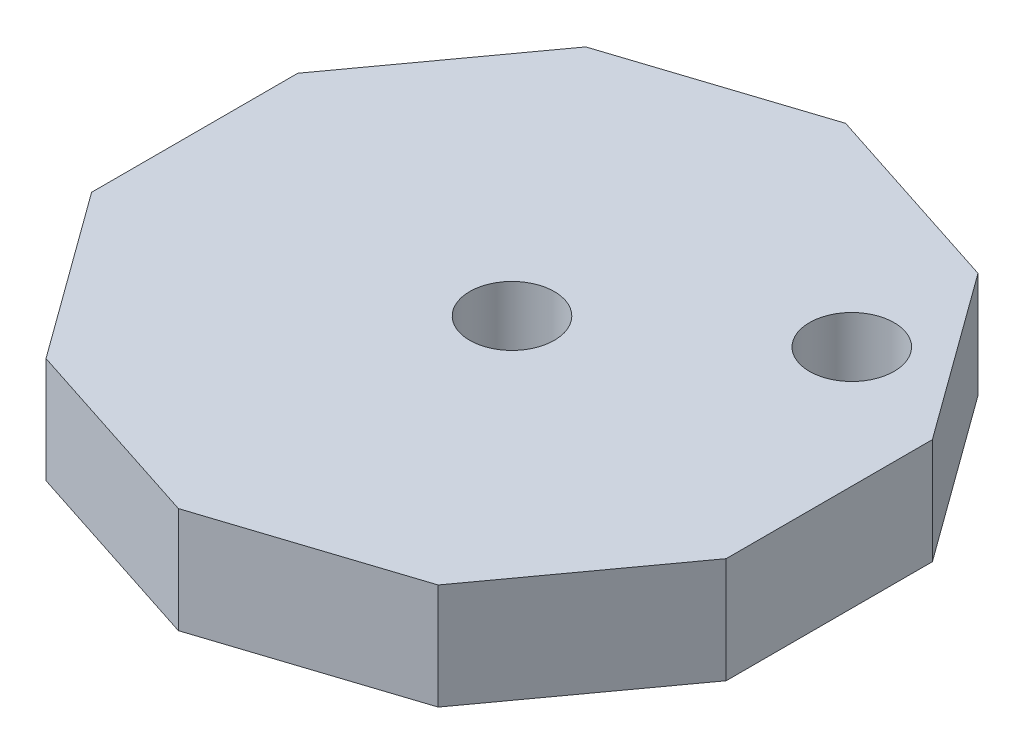
ISO-10303-21;
HEADER;
FILE_DESCRIPTION(('STEP AP214'),'2;1');
FILE_NAME('part.step','',(''),(''),'','','');
FILE_SCHEMA(('AUTOMOTIVE_DESIGN { 1 0 10303 214 1 1 1 1 }'));
ENDSEC;
DATA;
#1=APPLICATION_CONTEXT('core data for automotive mechanical design processes');
#2=APPLICATION_PROTOCOL_DEFINITION('international standard','automotive_design',2000,#1);
#3=PRODUCT_CONTEXT('',#1,'mechanical');
#4=PRODUCT('Part','Part','',(#3));
#5=PRODUCT_RELATED_PRODUCT_CATEGORY('part','',(#4));
#6=PRODUCT_DEFINITION_FORMATION('','',#4);
#7=PRODUCT_DEFINITION_CONTEXT('part definition',#1,'design');
#8=PRODUCT_DEFINITION('design','',#6,#7);
#9=PRODUCT_DEFINITION_SHAPE('','',#8);
#10=(LENGTH_UNIT() NAMED_UNIT(*) SI_UNIT(.MILLI.,.METRE.));
#11=(NAMED_UNIT(*) PLANE_ANGLE_UNIT() SI_UNIT($,.RADIAN.));
#12=(NAMED_UNIT(*) SI_UNIT($,.STERADIAN.) SOLID_ANGLE_UNIT());
#13=UNCERTAINTY_MEASURE_WITH_UNIT(LENGTH_MEASURE(1.E-05),#10,'distance_accuracy_value','');
#14=(GEOMETRIC_REPRESENTATION_CONTEXT(3) GLOBAL_UNCERTAINTY_ASSIGNED_CONTEXT((#13)) GLOBAL_UNIT_ASSIGNED_CONTEXT((#10,
#11,#12)) REPRESENTATION_CONTEXT('',''));
#15=CARTESIAN_POINT('',(0.,0.,0.));
#16=DIRECTION('',(0.,0.,1.));
#17=DIRECTION('',(1.,0.,0.));
#18=AXIS2_PLACEMENT_3D('',#15,#16,#17);
#19=CARTESIAN_POINT('',(9.27050983124844,5.,-12.7597621252807));
#20=DIRECTION('',(-0.309016994374947,0.,0.951056516295154));
#21=DIRECTION('',(0.951056516295154,0.,0.309016994374947));
#22=AXIS2_PLACEMENT_3D('',#19,#20,#21);
#23=PLANE('',#22);
#24=DIRECTION('',(-0.951056516295154,0.,-0.309016994374947));
#25=VECTOR('',#24,1.);
#26=CARTESIAN_POINT('',(9.27050983124844,0.,-12.7597621252807));
#27=LINE('',#26,#25);
#28=CARTESIAN_POINT('',(9.27050983124844,0.,-12.7597621252807));
#29=VERTEX_POINT('',#28);
#30=CARTESIAN_POINT('',(0.,0.,-15.7719333635741));
#31=VERTEX_POINT('',#30);
#32=EDGE_CURVE('E152',#29,#31,#27,.T.);
#33=ORIENTED_EDGE('',*,*,#32,.T.);
#34=DIRECTION('',(0.,-1.,0.));
#35=VECTOR('',#34,1.);
#36=CARTESIAN_POINT('',(0.,5.,-15.7719333635741));
#37=LINE('',#36,#35);
#38=CARTESIAN_POINT('',(0.,5.,-15.7719333635741));
#39=VERTEX_POINT('',#38);
#40=EDGE_CURVE('E11',#39,#31,#37,.T.);
#41=ORIENTED_EDGE('',*,*,#40,.F.);
#42=DIRECTION('',(-0.951056516295154,0.,-0.309016994374947));
#43=VECTOR('',#42,1.);
#44=CARTESIAN_POINT('',(9.27050983124844,5.,-12.7597621252807));
#45=LINE('',#44,#43);
#46=CARTESIAN_POINT('',(9.27050983124844,5.,-12.7597621252807));
#47=VERTEX_POINT('',#46);
#48=EDGE_CURVE('E181',#47,#39,#45,.T.);
#49=ORIENTED_EDGE('',*,*,#48,.F.);
#50=DIRECTION('',(0.,-1.,0.));
#51=VECTOR('',#50,1.);
#52=CARTESIAN_POINT('',(9.27050983124844,5.,-12.7597621252807));
#53=LINE('',#52,#51);
#54=EDGE_CURVE('E148',#47,#29,#53,.T.);
#55=ORIENTED_EDGE('',*,*,#54,.T.);
#56=EDGE_LOOP('',(#33,#41,#49,#55));
#57=FACE_BOUND('',#56,.T.);
#58=ADVANCED_FACE('F39',(#57),#23,.F.);
#59=CARTESIAN_POINT('',(0.,5.,-15.7719333635741));
#60=DIRECTION('',(0.309016994374948,0.,0.951056516295154));
#61=DIRECTION('',(0.951056516295154,0.,-0.309016994374948));
#62=AXIS2_PLACEMENT_3D('',#59,#60,#61);
#63=PLANE('',#62);
#64=DIRECTION('',(-0.951056516295154,0.,0.309016994374948));
#65=VECTOR('',#64,1.);
#66=CARTESIAN_POINT('',(0.,0.,-15.7719333635741));
#67=LINE('',#66,#65);
#68=CARTESIAN_POINT('',(-9.27050983124841,0.,-12.7597621252807));
#69=VERTEX_POINT('',#68);
#70=EDGE_CURVE('E156',#31,#69,#67,.T.);
#71=ORIENTED_EDGE('',*,*,#70,.T.);
#72=DIRECTION('',(0.,-1.,0.));
#73=VECTOR('',#72,1.);
#74=CARTESIAN_POINT('',(-9.27050983124841,5.,-12.7597621252807));
#75=LINE('',#74,#73);
#76=CARTESIAN_POINT('',(-9.27050983124841,5.,-12.7597621252807));
#77=VERTEX_POINT('',#76);
#78=EDGE_CURVE('E48',#77,#69,#75,.T.);
#79=ORIENTED_EDGE('',*,*,#78,.F.);
#80=DIRECTION('',(-0.951056516295154,0.,0.309016994374948));
#81=VECTOR('',#80,1.);
#82=CARTESIAN_POINT('',(0.,5.,-15.7719333635741));
#83=LINE('',#82,#81);
#84=EDGE_CURVE('E105',#39,#77,#83,.T.);
#85=ORIENTED_EDGE('',*,*,#84,.F.);
#86=ORIENTED_EDGE('',*,*,#40,.T.);
#87=EDGE_LOOP('',(#71,#79,#85,#86));
#88=FACE_BOUND('',#87,.T.);
#89=ADVANCED_FACE('F283',(#88),#63,.F.);
#90=CARTESIAN_POINT('',(-9.27050983124841,5.,-12.7597621252807));
#91=DIRECTION('',(0.809016994374947,0.,0.587785252292473));
#92=DIRECTION('',(0.587785252292473,0.,-0.809016994374948));
#93=AXIS2_PLACEMENT_3D('',#90,#91,#92);
#94=PLANE('',#93);
#95=DIRECTION('',(-0.587785252292473,0.,0.809016994374947));
#96=VECTOR('',#95,1.);
#97=CARTESIAN_POINT('',(-9.27050983124841,0.,-12.7597621252807));
#98=LINE('',#97,#96);
#99=CARTESIAN_POINT('',(-15.,0.,-4.87379544349371));
#100=VERTEX_POINT('',#99);
#101=EDGE_CURVE('E160',#69,#100,#98,.T.);
#102=ORIENTED_EDGE('',*,*,#101,.T.);
#103=DIRECTION('',(0.,-1.,0.));
#104=VECTOR('',#103,1.);
#105=CARTESIAN_POINT('',(-15.,5.,-4.87379544349371));
#106=LINE('',#105,#104);
#107=CARTESIAN_POINT('',(-15.,5.,-4.87379544349371));
#108=VERTEX_POINT('',#107);
#109=EDGE_CURVE('E200',#108,#100,#106,.T.);
#110=ORIENTED_EDGE('',*,*,#109,.F.);
#111=DIRECTION('',(-0.587785252292473,0.,0.809016994374947));
#112=VECTOR('',#111,1.);
#113=CARTESIAN_POINT('',(-9.27050983124841,5.,-12.7597621252807));
#114=LINE('',#113,#112);
#115=EDGE_CURVE('E210',#77,#108,#114,.T.);
#116=ORIENTED_EDGE('',*,*,#115,.F.);
#117=ORIENTED_EDGE('',*,*,#78,.T.);
#118=EDGE_LOOP('',(#102,#110,#116,#117));
#119=FACE_BOUND('',#118,.T.);
#120=ADVANCED_FACE('F208',(#119),#94,.F.);
#121=CARTESIAN_POINT('',(-15.,5.,-4.87379544349371));
#122=DIRECTION('',(1.,0.,0.));
#123=DIRECTION('',(0.,0.,-1.));
#124=AXIS2_PLACEMENT_3D('',#121,#122,#123);
#125=PLANE('',#124);
#126=DIRECTION('',(0.,0.,1.));
#127=VECTOR('',#126,1.);
#128=CARTESIAN_POINT('',(-15.,0.,-4.87379544349371));
#129=LINE('',#128,#127);
#130=CARTESIAN_POINT('',(-15.,0.,4.87379544349347));
#131=VERTEX_POINT('',#130);
#132=EDGE_CURVE('E163',#100,#131,#129,.T.);
#133=ORIENTED_EDGE('',*,*,#132,.T.);
#134=DIRECTION('',(0.,-1.,0.));
#135=VECTOR('',#134,1.);
#136=CARTESIAN_POINT('',(-15.,5.,4.87379544349347));
#137=LINE('',#136,#135);
#138=CARTESIAN_POINT('',(-15.,5.,4.87379544349347));
#139=VERTEX_POINT('',#138);
#140=EDGE_CURVE('E196',#139,#131,#137,.T.);
#141=ORIENTED_EDGE('',*,*,#140,.F.);
#142=DIRECTION('',(0.,0.,1.));
#143=VECTOR('',#142,1.);
#144=CARTESIAN_POINT('',(-15.,5.,-4.87379544349371));
#145=LINE('',#144,#143);
#146=EDGE_CURVE('E229',#108,#139,#145,.T.);
#147=ORIENTED_EDGE('',*,*,#146,.F.);
#148=ORIENTED_EDGE('',*,*,#109,.T.);
#149=EDGE_LOOP('',(#133,#141,#147,#148));
#150=FACE_BOUND('',#149,.T.);
#151=ADVANCED_FACE('F219',(#150),#125,.F.);
#152=CARTESIAN_POINT('',(-15.,5.,4.87379544349347));
#153=DIRECTION('',(0.809016994374947,0.,-0.587785252292473));
#154=DIRECTION('',(-0.587785252292473,0.,-0.809016994374948));
#155=AXIS2_PLACEMENT_3D('',#152,#153,#154);
#156=PLANE('',#155);
#157=DIRECTION('',(0.587785252292473,0.,0.809016994374947));
#158=VECTOR('',#157,1.);
#159=CARTESIAN_POINT('',(-15.,0.,4.87379544349347));
#160=LINE('',#159,#158);
#161=CARTESIAN_POINT('',(-9.2705098312484,0.,12.7597621252805));
#162=VERTEX_POINT('',#161);
#163=EDGE_CURVE('E166',#131,#162,#160,.T.);
#164=ORIENTED_EDGE('',*,*,#163,.T.);
#165=DIRECTION('',(0.,-1.,0.));
#166=VECTOR('',#165,1.);
#167=CARTESIAN_POINT('',(-9.2705098312484,5.,12.7597621252805));
#168=LINE('',#167,#166);
#169=CARTESIAN_POINT('',(-9.2705098312484,5.,12.7597621252805));
#170=VERTEX_POINT('',#169);
#171=EDGE_CURVE('E192',#170,#162,#168,.T.);
#172=ORIENTED_EDGE('',*,*,#171,.F.);
#173=DIRECTION('',(0.587785252292473,0.,0.809016994374947));
#174=VECTOR('',#173,1.);
#175=CARTESIAN_POINT('',(-15.,5.,4.87379544349347));
#176=LINE('',#175,#174);
#177=EDGE_CURVE('E225',#139,#170,#176,.T.);
#178=ORIENTED_EDGE('',*,*,#177,.F.);
#179=ORIENTED_EDGE('',*,*,#140,.T.);
#180=EDGE_LOOP('',(#164,#172,#178,#179));
#181=FACE_BOUND('',#180,.T.);
#182=ADVANCED_FACE('F223',(#181),#156,.F.);
#183=CARTESIAN_POINT('',(-9.2705098312484,5.,12.7597621252805));
#184=DIRECTION('',(0.309016994374947,0.,-0.951056516295154));
#185=DIRECTION('',(-0.951056516295154,0.,-0.309016994374947));
#186=AXIS2_PLACEMENT_3D('',#183,#184,#185);
#187=PLANE('',#186);
#188=DIRECTION('',(0.951056516295154,0.,0.309016994374947));
#189=VECTOR('',#188,1.);
#190=CARTESIAN_POINT('',(-9.2705098312484,0.,12.7597621252805));
#191=LINE('',#190,#189);
#192=CARTESIAN_POINT('',(0.,0.,15.7719333635739));
#193=VERTEX_POINT('',#192);
#194=EDGE_CURVE('E169',#162,#193,#191,.T.);
#195=ORIENTED_EDGE('',*,*,#194,.T.);
#196=DIRECTION('',(0.,-1.,0.));
#197=VECTOR('',#196,1.);
#198=CARTESIAN_POINT('',(0.,5.,15.7719333635739));
#199=LINE('',#198,#197);
#200=CARTESIAN_POINT('',(0.,5.,15.7719333635739));
#201=VERTEX_POINT('',#200);
#202=EDGE_CURVE('E188',#201,#193,#199,.T.);
#203=ORIENTED_EDGE('',*,*,#202,.F.);
#204=DIRECTION('',(0.951056516295154,0.,0.309016994374947));
#205=VECTOR('',#204,1.);
#206=CARTESIAN_POINT('',(-9.2705098312484,5.,12.7597621252805));
#207=LINE('',#206,#205);
#208=EDGE_CURVE('E228',#170,#201,#207,.T.);
#209=ORIENTED_EDGE('',*,*,#208,.F.);
#210=ORIENTED_EDGE('',*,*,#171,.T.);
#211=EDGE_LOOP('',(#195,#203,#209,#210));
#212=FACE_BOUND('',#211,.T.);
#213=ADVANCED_FACE('F295',(#212),#187,.F.);
#214=CARTESIAN_POINT('',(0.,5.,15.7719333635739));
#215=DIRECTION('',(-0.309016994374947,0.,-0.951056516295154));
#216=DIRECTION('',(-0.951056516295154,0.,0.309016994374947));
#217=AXIS2_PLACEMENT_3D('',#214,#215,#216);
#218=PLANE('',#217);
#219=DIRECTION('',(0.951056516295154,0.,-0.309016994374947));
#220=VECTOR('',#219,1.);
#221=CARTESIAN_POINT('',(0.,0.,15.7719333635739));
#222=LINE('',#221,#220);
#223=CARTESIAN_POINT('',(9.27050983124844,0.,12.7597621252805));
#224=VERTEX_POINT('',#223);
#225=EDGE_CURVE('E172',#193,#224,#222,.T.);
#226=ORIENTED_EDGE('',*,*,#225,.T.);
#227=DIRECTION('',(0.,-1.,0.));
#228=VECTOR('',#227,1.);
#229=CARTESIAN_POINT('',(9.27050983124844,5.,12.7597621252805));
#230=LINE('',#229,#228);
#231=CARTESIAN_POINT('',(9.27050983124844,5.,12.7597621252805));
#232=VERTEX_POINT('',#231);
#233=EDGE_CURVE('E141',#232,#224,#230,.T.);
#234=ORIENTED_EDGE('',*,*,#233,.F.);
#235=DIRECTION('',(0.951056516295154,0.,-0.309016994374947));
#236=VECTOR('',#235,1.);
#237=CARTESIAN_POINT('',(0.,5.,15.7719333635739));
#238=LINE('',#237,#236);
#239=EDGE_CURVE('E130',#201,#232,#238,.T.);
#240=ORIENTED_EDGE('',*,*,#239,.F.);
#241=ORIENTED_EDGE('',*,*,#202,.T.);
#242=EDGE_LOOP('',(#226,#234,#240,#241));
#243=FACE_BOUND('',#242,.T.);
#244=ADVANCED_FACE('F292',(#243),#218,.F.);
#245=CARTESIAN_POINT('',(9.27050983124844,5.,12.7597621252805));
#246=DIRECTION('',(-0.809016994374947,0.,-0.587785252292473));
#247=DIRECTION('',(-0.587785252292473,0.,0.809016994374948));
#248=AXIS2_PLACEMENT_3D('',#245,#246,#247);
#249=PLANE('',#248);
#250=DIRECTION('',(0.587785252292473,0.,-0.809016994374947));
#251=VECTOR('',#250,1.);
#252=CARTESIAN_POINT('',(9.27050983124844,0.,12.7597621252805));
#253=LINE('',#252,#251);
#254=CARTESIAN_POINT('',(15.,0.,4.87379544349347));
#255=VERTEX_POINT('',#254);
#256=EDGE_CURVE('E139',#224,#255,#253,.T.);
#257=ORIENTED_EDGE('',*,*,#256,.T.);
#258=DIRECTION('',(0.,-1.,0.));
#259=VECTOR('',#258,1.);
#260=CARTESIAN_POINT('',(15.,5.,4.87379544349347));
#261=LINE('',#260,#259);
#262=CARTESIAN_POINT('',(15.,5.,4.87379544349347));
#263=VERTEX_POINT('',#262);
#264=EDGE_CURVE('E136',#263,#255,#261,.T.);
#265=ORIENTED_EDGE('',*,*,#264,.F.);
#266=DIRECTION('',(0.587785252292473,0.,-0.809016994374947));
#267=VECTOR('',#266,1.);
#268=CARTESIAN_POINT('',(9.27050983124844,5.,12.7597621252805));
#269=LINE('',#268,#267);
#270=EDGE_CURVE('E124',#232,#263,#269,.T.);
#271=ORIENTED_EDGE('',*,*,#270,.F.);
#272=ORIENTED_EDGE('',*,*,#233,.T.);
#273=EDGE_LOOP('',(#257,#265,#271,#272));
#274=FACE_BOUND('',#273,.T.);
#275=ADVANCED_FACE('F137',(#274),#249,.F.);
#276=CARTESIAN_POINT('',(15.,5.,4.87379544349347));
#277=DIRECTION('',(-1.,0.,0.));
#278=DIRECTION('',(0.,0.,1.));
#279=AXIS2_PLACEMENT_3D('',#276,#277,#278);
#280=PLANE('',#279);
#281=DIRECTION('',(0.,0.,-1.));
#282=VECTOR('',#281,1.);
#283=CARTESIAN_POINT('',(15.,0.,4.87379544349347));
#284=LINE('',#283,#282);
#285=CARTESIAN_POINT('',(15.,0.,-4.87379544349372));
#286=VERTEX_POINT('',#285);
#287=EDGE_CURVE('E91',#255,#286,#284,.T.);
#288=ORIENTED_EDGE('',*,*,#287,.T.);
#289=DIRECTION('',(0.,-1.,0.));
#290=VECTOR('',#289,1.);
#291=CARTESIAN_POINT('',(15.,5.,-4.87379544349372));
#292=LINE('',#291,#290);
#293=CARTESIAN_POINT('',(15.,5.,-4.87379544349372));
#294=VERTEX_POINT('',#293);
#295=EDGE_CURVE('E142',#294,#286,#292,.T.);
#296=ORIENTED_EDGE('',*,*,#295,.F.);
#297=DIRECTION('',(0.,0.,-1.));
#298=VECTOR('',#297,1.);
#299=CARTESIAN_POINT('',(15.,5.,4.87379544349347));
#300=LINE('',#299,#298);
#301=EDGE_CURVE('E128',#263,#294,#300,.T.);
#302=ORIENTED_EDGE('',*,*,#301,.F.);
#303=ORIENTED_EDGE('',*,*,#264,.T.);
#304=EDGE_LOOP('',(#288,#296,#302,#303));
#305=FACE_BOUND('',#304,.T.);
#306=ADVANCED_FACE('F144',(#305),#280,.F.);
#307=CARTESIAN_POINT('',(15.,5.,-4.87379544349372));
#308=DIRECTION('',(-0.809016994374947,0.,0.587785252292473));
#309=DIRECTION('',(0.587785252292473,0.,0.809016994374947));
#310=AXIS2_PLACEMENT_3D('',#307,#308,#309);
#311=PLANE('',#310);
#312=DIRECTION('',(-0.587785252292473,0.,-0.809016994374947));
#313=VECTOR('',#312,1.);
#314=CARTESIAN_POINT('',(15.,0.,-4.87379544349372));
#315=LINE('',#314,#313);
#316=EDGE_CURVE('E97',#286,#29,#315,.T.);
#317=ORIENTED_EDGE('',*,*,#316,.T.);
#318=ORIENTED_EDGE('',*,*,#54,.F.);
#319=DIRECTION('',(-0.587785252292473,0.,-0.809016994374947));
#320=VECTOR('',#319,1.);
#321=CARTESIAN_POINT('',(15.,5.,-4.87379544349372));
#322=LINE('',#321,#320);
#323=EDGE_CURVE('E56',#294,#47,#322,.T.);
#324=ORIENTED_EDGE('',*,*,#323,.F.);
#325=ORIENTED_EDGE('',*,*,#295,.T.);
#326=EDGE_LOOP('',(#317,#318,#324,#325));
#327=FACE_BOUND('',#326,.T.);
#328=ADVANCED_FACE('F270',(#327),#311,.F.);
#329=CARTESIAN_POINT('',(0.,5.,0.));
#330=DIRECTION('',(0.,1.,0.));
#331=DIRECTION('',(0.,0.,1.));
#332=AXIS2_PLACEMENT_3D('',#329,#330,#331);
#333=PLANE('',#332);
#334=CARTESIAN_POINT('',(9.30369543531192,5.,-6.75953040136355));
#335=DIRECTION('',(0.,1.,0.));
#336=DIRECTION('',(0.,0.,1.));
#337=AXIS2_PLACEMENT_3D('',#334,#335,#336);
#338=CIRCLE('',#337,2.);
#339=CARTESIAN_POINT('',(9.30369543531192,5.,-4.75953040136355));
#340=VERTEX_POINT('',#339);
#341=EDGE_CURVE('E251',#340,#340,#338,.T.);
#342=ORIENTED_EDGE('',*,*,#341,.F.);
#343=EDGE_LOOP('',(#342));
#344=FACE_BOUND('',#343,.T.);
#345=CARTESIAN_POINT('',(0.,5.,0.));
#346=DIRECTION('',(0.,1.,0.));
#347=DIRECTION('',(0.,0.,1.));
#348=AXIS2_PLACEMENT_3D('',#345,#346,#347);
#349=CIRCLE('',#348,2.);
#350=CARTESIAN_POINT('',(0.,5.,2.));
#351=VERTEX_POINT('',#350);
#352=EDGE_CURVE('E247',#351,#351,#349,.T.);
#353=ORIENTED_EDGE('',*,*,#352,.F.);
#354=EDGE_LOOP('',(#353));
#355=FACE_BOUND('',#354,.T.);
#356=ORIENTED_EDGE('',*,*,#48,.T.);
#357=ORIENTED_EDGE('',*,*,#84,.T.);
#358=ORIENTED_EDGE('',*,*,#115,.T.);
#359=ORIENTED_EDGE('',*,*,#146,.T.);
#360=ORIENTED_EDGE('',*,*,#177,.T.);
#361=ORIENTED_EDGE('',*,*,#208,.T.);
#362=ORIENTED_EDGE('',*,*,#239,.T.);
#363=ORIENTED_EDGE('',*,*,#270,.T.);
#364=ORIENTED_EDGE('',*,*,#301,.T.);
#365=ORIENTED_EDGE('',*,*,#323,.T.);
#366=EDGE_LOOP('',(#356,#357,#358,#359,#360,#361,#362,#363,#364,#365));
#367=FACE_BOUND('',#366,.T.);
#368=ADVANCED_FACE('F126',(#344,#355,#367),#333,.T.);
#369=CARTESIAN_POINT('',(0.,0.,0.));
#370=DIRECTION('',(0.,1.,0.));
#371=DIRECTION('',(0.,0.,1.));
#372=AXIS2_PLACEMENT_3D('',#369,#370,#371);
#373=PLANE('',#372);
#374=CARTESIAN_POINT('',(9.30369543531192,0.,-6.75953040136355));
#375=DIRECTION('',(0.,1.,0.));
#376=DIRECTION('',(0.,0.,1.));
#377=AXIS2_PLACEMENT_3D('',#374,#375,#376);
#378=CIRCLE('',#377,2.);
#379=CARTESIAN_POINT('',(9.30369543531192,0.,-4.75953040136355));
#380=VERTEX_POINT('',#379);
#381=EDGE_CURVE('E157',#380,#380,#378,.T.);
#382=ORIENTED_EDGE('',*,*,#381,.T.);
#383=EDGE_LOOP('',(#382));
#384=FACE_BOUND('',#383,.T.);
#385=CARTESIAN_POINT('',(0.,0.,0.));
#386=DIRECTION('',(0.,1.,0.));
#387=DIRECTION('',(0.,0.,1.));
#388=AXIS2_PLACEMENT_3D('',#385,#386,#387);
#389=CIRCLE('',#388,2.);
#390=CARTESIAN_POINT('',(0.,0.,2.));
#391=VERTEX_POINT('',#390);
#392=EDGE_CURVE('E243',#391,#391,#389,.T.);
#393=ORIENTED_EDGE('',*,*,#392,.T.);
#394=EDGE_LOOP('',(#393));
#395=FACE_BOUND('',#394,.T.);
#396=ORIENTED_EDGE('',*,*,#32,.F.);
#397=ORIENTED_EDGE('',*,*,#316,.F.);
#398=ORIENTED_EDGE('',*,*,#287,.F.);
#399=ORIENTED_EDGE('',*,*,#256,.F.);
#400=ORIENTED_EDGE('',*,*,#225,.F.);
#401=ORIENTED_EDGE('',*,*,#194,.F.);
#402=ORIENTED_EDGE('',*,*,#163,.F.);
#403=ORIENTED_EDGE('',*,*,#132,.F.);
#404=ORIENTED_EDGE('',*,*,#101,.F.);
#405=ORIENTED_EDGE('',*,*,#70,.F.);
#406=EDGE_LOOP('',(#396,#397,#398,#399,#400,#401,#402,#403,#404,#405));
#407=FACE_BOUND('',#406,.T.);
#408=ADVANCED_FACE('F214',(#384,#395,#407),#373,.F.);
#409=CARTESIAN_POINT('',(0.,0.,0.));
#410=DIRECTION('',(0.,1.,0.));
#411=DIRECTION('',(0.,0.,1.));
#412=AXIS2_PLACEMENT_3D('',#409,#410,#411);
#413=CYLINDRICAL_SURFACE('',#412,2.);
#414=ORIENTED_EDGE('',*,*,#392,.F.);
#415=EDGE_LOOP('',(#414));
#416=FACE_BOUND('',#415,.T.);
#417=ORIENTED_EDGE('',*,*,#352,.T.);
#418=EDGE_LOOP('',(#417));
#419=FACE_BOUND('',#418,.T.);
#420=ADVANCED_FACE('F264',(#416,#419),#413,.F.);
#421=CARTESIAN_POINT('',(9.30369543531192,0.,-6.75953040136355));
#422=DIRECTION('',(0.,1.,0.));
#423=DIRECTION('',(0.,0.,1.));
#424=AXIS2_PLACEMENT_3D('',#421,#422,#423);
#425=CYLINDRICAL_SURFACE('',#424,2.);
#426=ORIENTED_EDGE('',*,*,#381,.F.);
#427=EDGE_LOOP('',(#426));
#428=FACE_BOUND('',#427,.T.);
#429=ORIENTED_EDGE('',*,*,#341,.T.);
#430=EDGE_LOOP('',(#429));
#431=FACE_BOUND('',#430,.T.);
#432=ADVANCED_FACE('F261',(#428,#431),#425,.F.);
#433=CLOSED_SHELL('',(#58,#89,#120,#151,#182,#213,#244,#275,#306,#328,#368,#408,#420,#432));
#434=MANIFOLD_SOLID_BREP('B2',#433);
#435=ADVANCED_BREP_SHAPE_REPRESENTATION('',(#18,#434),#14);
#436=SHAPE_DEFINITION_REPRESENTATION(#9,#435);
ENDSEC;
END-ISO-10303-21;
